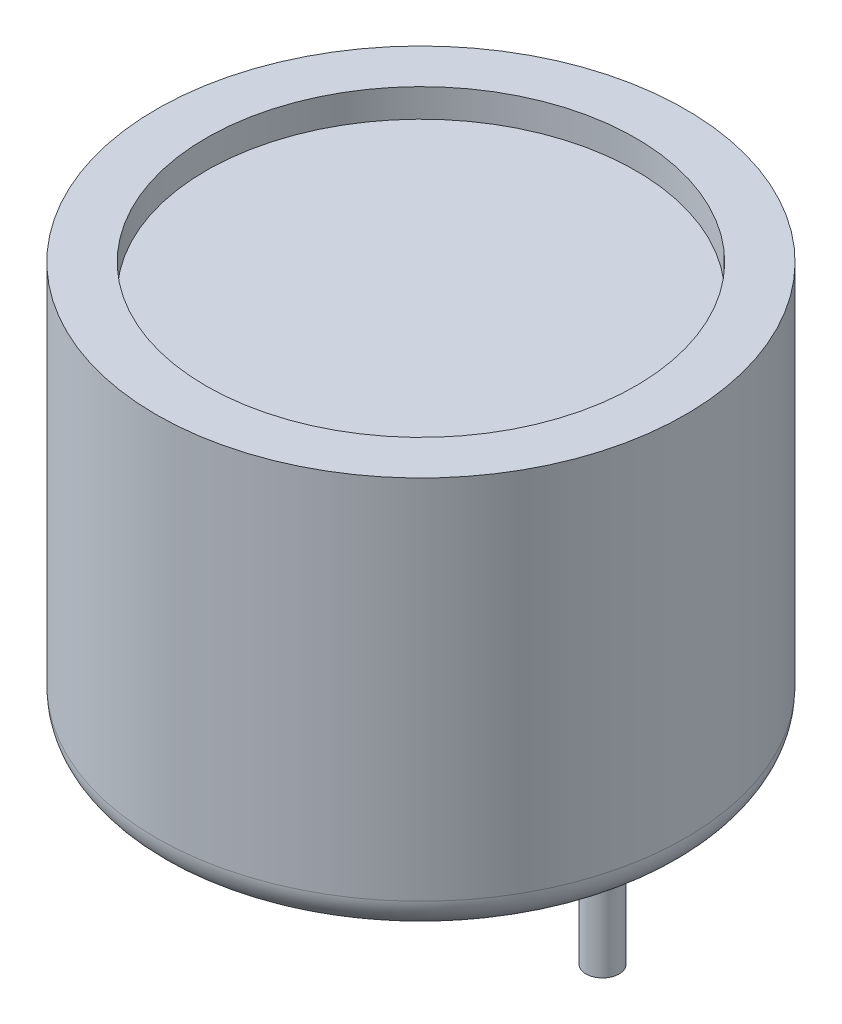
ISO-10303-21;
HEADER;
FILE_DESCRIPTION(('STEP AP214'),'2;1');
FILE_NAME('part.step','',(''),(''),'','','');
FILE_SCHEMA(('AUTOMOTIVE_DESIGN { 1 0 10303 214 1 1 1 1 }'));
ENDSEC;
DATA;
#1=APPLICATION_CONTEXT('core data for automotive mechanical design processes');
#2=APPLICATION_PROTOCOL_DEFINITION('international standard','automotive_design',2000,#1);
#3=PRODUCT_CONTEXT('',#1,'mechanical');
#4=PRODUCT('Part','Part','',(#3));
#5=PRODUCT_RELATED_PRODUCT_CATEGORY('part','',(#4));
#6=PRODUCT_DEFINITION_FORMATION('','',#4);
#7=PRODUCT_DEFINITION_CONTEXT('part definition',#1,'design');
#8=PRODUCT_DEFINITION('design','',#6,#7);
#9=PRODUCT_DEFINITION_SHAPE('','',#8);
#10=(LENGTH_UNIT() NAMED_UNIT(*) SI_UNIT(.MILLI.,.METRE.));
#11=(NAMED_UNIT(*) PLANE_ANGLE_UNIT() SI_UNIT($,.RADIAN.));
#12=(NAMED_UNIT(*) SI_UNIT($,.STERADIAN.) SOLID_ANGLE_UNIT());
#13=UNCERTAINTY_MEASURE_WITH_UNIT(LENGTH_MEASURE(1.E-05),#10,'distance_accuracy_value','');
#14=(GEOMETRIC_REPRESENTATION_CONTEXT(3) GLOBAL_UNCERTAINTY_ASSIGNED_CONTEXT((#13)) GLOBAL_UNIT_ASSIGNED_CONTEXT((#10,
#11,#12)) REPRESENTATION_CONTEXT('',''));
#15=CARTESIAN_POINT('',(0.,0.,0.));
#16=DIRECTION('',(0.,0.,1.));
#17=DIRECTION('',(1.,0.,0.));
#18=AXIS2_PLACEMENT_3D('',#15,#16,#17);
#19=CARTESIAN_POINT('',(0.,12.05,0.));
#20=DIRECTION('',(0.,-1.,0.));
#21=DIRECTION('',(0.,0.,-1.));
#22=AXIS2_PLACEMENT_3D('',#19,#20,#21);
#23=CYLINDRICAL_SURFACE('',#22,7.975);
#24=CARTESIAN_POINT('',(0.,0.999999999999999,0.));
#25=DIRECTION('',(0.,1.,0.));
#26=DIRECTION('',(0.,0.,1.));
#27=AXIS2_PLACEMENT_3D('',#24,#25,#26);
#28=CIRCLE('',#27,7.975);
#29=CARTESIAN_POINT('',(0.,0.999999999999999,7.975));
#30=VERTEX_POINT('',#29);
#31=EDGE_CURVE('E10',#30,#30,#28,.T.);
#32=ORIENTED_EDGE('',*,*,#31,.T.);
#33=EDGE_LOOP('',(#32));
#34=FACE_BOUND('',#33,.T.);
#35=CARTESIAN_POINT('',(0.,12.05,0.));
#36=DIRECTION('',(0.,1.,0.));
#37=DIRECTION('',(0.,0.,1.));
#38=AXIS2_PLACEMENT_3D('',#35,#36,#37);
#39=CIRCLE('',#38,7.975);
#40=CARTESIAN_POINT('',(0.,12.05,7.975));
#41=VERTEX_POINT('',#40);
#42=EDGE_CURVE('E47',#41,#41,#39,.T.);
#43=ORIENTED_EDGE('',*,*,#42,.F.);
#44=EDGE_LOOP('',(#43));
#45=FACE_BOUND('',#44,.T.);
#46=ADVANCED_FACE('F39',(#34,#45),#23,.T.);
#47=CARTESIAN_POINT('',(0.,12.05,0.));
#48=DIRECTION('',(0.,1.,0.));
#49=DIRECTION('',(0.,0.,1.));
#50=AXIS2_PLACEMENT_3D('',#47,#48,#49);
#51=PLANE('',#50);
#52=CARTESIAN_POINT('',(0.,12.05,0.));
#53=DIRECTION('',(0.,1.,0.));
#54=DIRECTION('',(0.,0.,1.));
#55=AXIS2_PLACEMENT_3D('',#52,#53,#54);
#56=CIRCLE('',#55,6.475);
#57=CARTESIAN_POINT('',(0.,12.05,6.475));
#58=VERTEX_POINT('',#57);
#59=EDGE_CURVE('E80',#58,#58,#56,.T.);
#60=ORIENTED_EDGE('',*,*,#59,.F.);
#61=EDGE_LOOP('',(#60));
#62=FACE_BOUND('',#61,.T.);
#63=ORIENTED_EDGE('',*,*,#42,.T.);
#64=EDGE_LOOP('',(#63));
#65=FACE_BOUND('',#64,.T.);
#66=ADVANCED_FACE('F97',(#62,#65),#51,.T.);
#67=CARTESIAN_POINT('',(0.,0.999999999999999,0.));
#68=DIRECTION('',(0.,1.,0.));
#69=DIRECTION('',(0.,0.,1.));
#70=AXIS2_PLACEMENT_3D('',#67,#68,#69);
#71=TOROIDAL_SURFACE('',#70,6.975,1.);
#72=CARTESIAN_POINT('',(0.,0.,0.));
#73=DIRECTION('',(0.,-1.,0.));
#74=DIRECTION('',(0.,0.,-1.));
#75=AXIS2_PLACEMENT_3D('',#72,#73,#74);
#76=CIRCLE('',#75,6.975);
#77=CARTESIAN_POINT('',(0.,0.,-6.975));
#78=VERTEX_POINT('',#77);
#79=EDGE_CURVE('E57',#78,#78,#76,.T.);
#80=ORIENTED_EDGE('',*,*,#79,.F.);
#81=EDGE_LOOP('',(#80));
#82=FACE_BOUND('',#81,.T.);
#83=ORIENTED_EDGE('',*,*,#31,.F.);
#84=EDGE_LOOP('',(#83));
#85=FACE_BOUND('',#84,.T.);
#86=ADVANCED_FACE('F41',(#82,#85),#71,.T.);
#87=CARTESIAN_POINT('',(0.,0.75,0.));
#88=DIRECTION('',(0.,-1.,0.));
#89=DIRECTION('',(0.,0.,-1.));
#90=AXIS2_PLACEMENT_3D('',#87,#88,#89);
#91=CYLINDRICAL_SURFACE('',#90,6.975);
#92=CARTESIAN_POINT('',(0.,0.75,0.));
#93=DIRECTION('',(0.,-1.,0.));
#94=DIRECTION('',(0.,0.,-1.));
#95=AXIS2_PLACEMENT_3D('',#92,#93,#94);
#96=CIRCLE('',#95,6.975);
#97=CARTESIAN_POINT('',(0.,0.75,-6.975));
#98=VERTEX_POINT('',#97);
#99=EDGE_CURVE('E52',#98,#98,#96,.T.);
#100=ORIENTED_EDGE('',*,*,#99,.F.);
#101=EDGE_LOOP('',(#100));
#102=FACE_BOUND('',#101,.T.);
#103=ORIENTED_EDGE('',*,*,#79,.T.);
#104=EDGE_LOOP('',(#103));
#105=FACE_BOUND('',#104,.T.);
#106=ADVANCED_FACE('F104',(#102,#105),#91,.F.);
#107=CARTESIAN_POINT('',(0.,0.75,0.));
#108=DIRECTION('',(0.,-1.,0.));
#109=DIRECTION('',(0.,0.,-1.));
#110=AXIS2_PLACEMENT_3D('',#107,#108,#109);
#111=PLANE('',#110);
#112=CARTESIAN_POINT('',(5.475,0.75,0.));
#113=DIRECTION('',(0.,-1.,0.));
#114=DIRECTION('',(0.,0.,-1.));
#115=AXIS2_PLACEMENT_3D('',#112,#113,#114);
#116=CIRCLE('',#115,0.500000000000001);
#117=CARTESIAN_POINT('',(5.475,0.75,-0.500000000000001));
#118=VERTEX_POINT('',#117);
#119=EDGE_CURVE('E72',#118,#118,#116,.T.);
#120=ORIENTED_EDGE('',*,*,#119,.F.);
#121=EDGE_LOOP('',(#120));
#122=FACE_BOUND('',#121,.T.);
#123=CARTESIAN_POINT('',(-5.475,0.75,0.));
#124=DIRECTION('',(0.,-1.,0.));
#125=DIRECTION('',(0.,0.,-1.));
#126=AXIS2_PLACEMENT_3D('',#123,#124,#125);
#127=CIRCLE('',#126,0.500000000000001);
#128=CARTESIAN_POINT('',(-5.475,0.75,-0.500000000000001));
#129=VERTEX_POINT('',#128);
#130=EDGE_CURVE('E64',#129,#129,#127,.T.);
#131=ORIENTED_EDGE('',*,*,#130,.F.);
#132=EDGE_LOOP('',(#131));
#133=FACE_BOUND('',#132,.T.);
#134=ORIENTED_EDGE('',*,*,#99,.T.);
#135=EDGE_LOOP('',(#134));
#136=FACE_BOUND('',#135,.T.);
#137=ADVANCED_FACE('F109',(#122,#133,#136),#111,.T.);
#138=CARTESIAN_POINT('',(-5.475,-3.55,0.));
#139=DIRECTION('',(0.,1.,0.));
#140=DIRECTION('',(0.,0.,1.));
#141=AXIS2_PLACEMENT_3D('',#138,#139,#140);
#142=CYLINDRICAL_SURFACE('',#141,0.500000000000001);
#143=CARTESIAN_POINT('',(-5.475,-3.55,0.));
#144=DIRECTION('',(0.,-1.,0.));
#145=DIRECTION('',(0.,0.,-1.));
#146=AXIS2_PLACEMENT_3D('',#143,#144,#145);
#147=CIRCLE('',#146,0.500000000000001);
#148=CARTESIAN_POINT('',(-5.475,-3.55,-0.500000000000001));
#149=VERTEX_POINT('',#148);
#150=EDGE_CURVE('E62',#149,#149,#147,.T.);
#151=ORIENTED_EDGE('',*,*,#150,.F.);
#152=EDGE_LOOP('',(#151));
#153=FACE_BOUND('',#152,.T.);
#154=ORIENTED_EDGE('',*,*,#130,.T.);
#155=EDGE_LOOP('',(#154));
#156=FACE_BOUND('',#155,.T.);
#157=ADVANCED_FACE('F113',(#153,#156),#142,.T.);
#158=CARTESIAN_POINT('',(-5.475,-3.55,0.));
#159=DIRECTION('',(0.,-1.,0.));
#160=DIRECTION('',(0.,0.,-1.));
#161=AXIS2_PLACEMENT_3D('',#158,#159,#160);
#162=PLANE('',#161);
#163=ORIENTED_EDGE('',*,*,#150,.T.);
#164=EDGE_LOOP('',(#163));
#165=FACE_BOUND('',#164,.T.);
#166=ADVANCED_FACE('F117',(#165),#162,.T.);
#167=CARTESIAN_POINT('',(5.475,-3.55,0.));
#168=DIRECTION('',(0.,1.,0.));
#169=DIRECTION('',(0.,0.,1.));
#170=AXIS2_PLACEMENT_3D('',#167,#168,#169);
#171=CYLINDRICAL_SURFACE('',#170,0.500000000000001);
#172=CARTESIAN_POINT('',(5.475,-3.55,0.));
#173=DIRECTION('',(0.,-1.,0.));
#174=DIRECTION('',(0.,0.,-1.));
#175=AXIS2_PLACEMENT_3D('',#172,#173,#174);
#176=CIRCLE('',#175,0.500000000000001);
#177=CARTESIAN_POINT('',(5.475,-3.55,-0.500000000000001));
#178=VERTEX_POINT('',#177);
#179=EDGE_CURVE('E68',#178,#178,#176,.T.);
#180=ORIENTED_EDGE('',*,*,#179,.F.);
#181=EDGE_LOOP('',(#180));
#182=FACE_BOUND('',#181,.T.);
#183=ORIENTED_EDGE('',*,*,#119,.T.);
#184=EDGE_LOOP('',(#183));
#185=FACE_BOUND('',#184,.T.);
#186=ADVANCED_FACE('F121',(#182,#185),#171,.T.);
#187=CARTESIAN_POINT('',(5.475,-3.55,0.));
#188=DIRECTION('',(0.,-1.,0.));
#189=DIRECTION('',(0.,0.,-1.));
#190=AXIS2_PLACEMENT_3D('',#187,#188,#189);
#191=PLANE('',#190);
#192=ORIENTED_EDGE('',*,*,#179,.T.);
#193=EDGE_LOOP('',(#192));
#194=FACE_BOUND('',#193,.T.);
#195=ADVANCED_FACE('F93',(#194),#191,.T.);
#196=CARTESIAN_POINT('',(0.,11.2,0.));
#197=DIRECTION('',(0.,1.,0.));
#198=DIRECTION('',(0.,0.,1.));
#199=AXIS2_PLACEMENT_3D('',#196,#197,#198);
#200=CYLINDRICAL_SURFACE('',#199,6.475);
#201=CARTESIAN_POINT('',(0.,11.2,0.));
#202=DIRECTION('',(0.,1.,0.));
#203=DIRECTION('',(0.,0.,1.));
#204=AXIS2_PLACEMENT_3D('',#201,#202,#203);
#205=CIRCLE('',#204,6.475);
#206=CARTESIAN_POINT('',(0.,11.2,6.475));
#207=VERTEX_POINT('',#206);
#208=EDGE_CURVE('E76',#207,#207,#205,.T.);
#209=ORIENTED_EDGE('',*,*,#208,.F.);
#210=EDGE_LOOP('',(#209));
#211=FACE_BOUND('',#210,.T.);
#212=ORIENTED_EDGE('',*,*,#59,.T.);
#213=EDGE_LOOP('',(#212));
#214=FACE_BOUND('',#213,.T.);
#215=ADVANCED_FACE('F90',(#211,#214),#200,.F.);
#216=CARTESIAN_POINT('',(0.,11.2,0.));
#217=DIRECTION('',(0.,1.,0.));
#218=DIRECTION('',(0.,0.,1.));
#219=AXIS2_PLACEMENT_3D('',#216,#217,#218);
#220=PLANE('',#219);
#221=ORIENTED_EDGE('',*,*,#208,.T.);
#222=EDGE_LOOP('',(#221));
#223=FACE_BOUND('',#222,.T.);
#224=ADVANCED_FACE('F88',(#223),#220,.T.);
#225=CLOSED_SHELL('',(#46,#66,#86,#106,#137,#157,#166,#186,#195,#215,#224));
#226=MANIFOLD_SOLID_BREP('B2',#225);
#227=ADVANCED_BREP_SHAPE_REPRESENTATION('',(#18,#226),#14);
#228=SHAPE_DEFINITION_REPRESENTATION(#9,#227);
ENDSEC;
END-ISO-10303-21;
